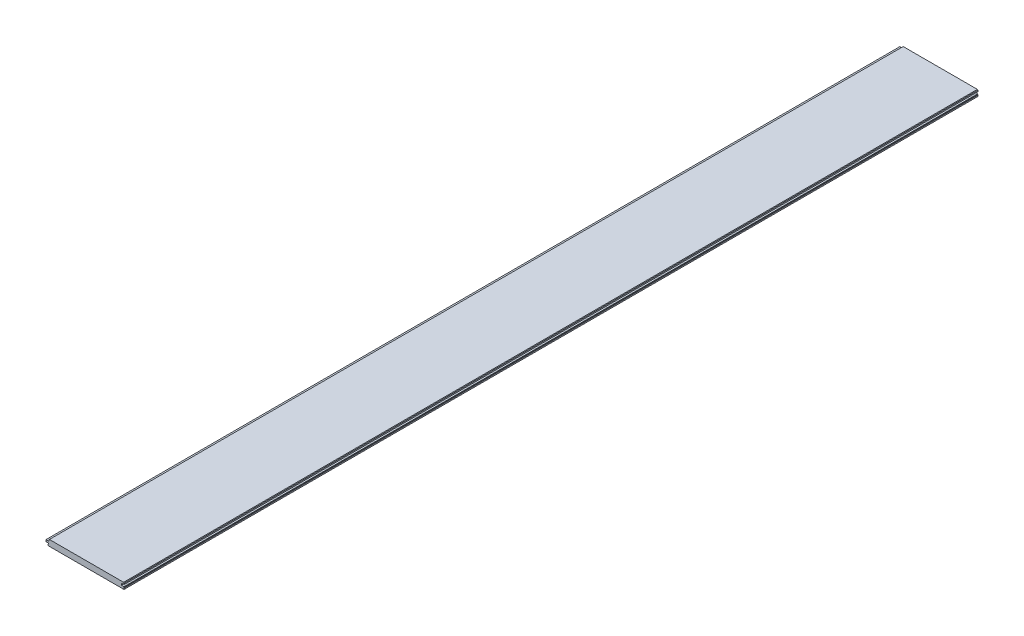
ISO-10303-21;
HEADER;
FILE_DESCRIPTION(('STEP AP214'),'2;1');
FILE_NAME('part.step','',(''),(''),'','','');
FILE_SCHEMA(('AUTOMOTIVE_DESIGN { 1 0 10303 214 1 1 1 1 }'));
ENDSEC;
DATA;
#1=APPLICATION_CONTEXT('core data for automotive mechanical design processes');
#2=APPLICATION_PROTOCOL_DEFINITION('international standard','automotive_design',2000,#1);
#3=PRODUCT_CONTEXT('',#1,'mechanical');
#4=PRODUCT('Part','Part','',(#3));
#5=PRODUCT_RELATED_PRODUCT_CATEGORY('part','',(#4));
#6=PRODUCT_DEFINITION_FORMATION('','',#4);
#7=PRODUCT_DEFINITION_CONTEXT('part definition',#1,'design');
#8=PRODUCT_DEFINITION('design','',#6,#7);
#9=PRODUCT_DEFINITION_SHAPE('','',#8);
#10=(LENGTH_UNIT() NAMED_UNIT(*) SI_UNIT(.MILLI.,.METRE.));
#11=(NAMED_UNIT(*) PLANE_ANGLE_UNIT() SI_UNIT($,.RADIAN.));
#12=(NAMED_UNIT(*) SI_UNIT($,.STERADIAN.) SOLID_ANGLE_UNIT());
#13=UNCERTAINTY_MEASURE_WITH_UNIT(LENGTH_MEASURE(1.E-05),#10,'distance_accuracy_value','');
#14=(GEOMETRIC_REPRESENTATION_CONTEXT(3) GLOBAL_UNCERTAINTY_ASSIGNED_CONTEXT((#13)) GLOBAL_UNIT_ASSIGNED_CONTEXT((#10,
#11,#12)) REPRESENTATION_CONTEXT('',''));
#15=CARTESIAN_POINT('',(0.,0.,0.));
#16=DIRECTION('',(0.,0.,1.));
#17=DIRECTION('',(1.,0.,0.));
#18=AXIS2_PLACEMENT_3D('',#15,#16,#17);
#19=CARTESIAN_POINT('',(94.83725,0.,1066.8));
#20=DIRECTION('',(-1.,0.,0.));
#21=DIRECTION('',(0.,0.,1.));
#22=AXIS2_PLACEMENT_3D('',#19,#20,#21);
#23=PLANE('',#22);
#24=DIRECTION('',(0.,1.,0.));
#25=VECTOR('',#24,1.);
#26=CARTESIAN_POINT('',(94.83725,0.,-1066.8));
#27=LINE('',#26,#25);
#28=CARTESIAN_POINT('',(94.83725,3.12419999999999,-1066.8));
#29=VERTEX_POINT('',#28);
#30=CARTESIAN_POINT('',(94.83725,6.28649999999999,-1066.8));
#31=VERTEX_POINT('',#30);
#32=EDGE_CURVE('E206',#29,#31,#27,.T.);
#33=ORIENTED_EDGE('',*,*,#32,.T.);
#34=DIRECTION('',(0.,0.,-1.));
#35=VECTOR('',#34,1.);
#36=CARTESIAN_POINT('',(94.83725,6.28649999999999,1066.8));
#37=LINE('',#36,#35);
#38=CARTESIAN_POINT('',(94.83725,6.28649999999999,1066.8));
#39=VERTEX_POINT('',#38);
#40=EDGE_CURVE('E12',#39,#31,#37,.T.);
#41=ORIENTED_EDGE('',*,*,#40,.F.);
#42=DIRECTION('',(0.,1.,0.));
#43=VECTOR('',#42,1.);
#44=CARTESIAN_POINT('',(94.83725,0.,1066.8));
#45=LINE('',#44,#43);
#46=CARTESIAN_POINT('',(94.83725,3.12419999999999,1066.8));
#47=VERTEX_POINT('',#46);
#48=EDGE_CURVE('E256',#47,#39,#45,.T.);
#49=ORIENTED_EDGE('',*,*,#48,.F.);
#50=DIRECTION('',(0.,0.,-1.));
#51=VECTOR('',#50,1.);
#52=CARTESIAN_POINT('',(94.83725,3.12419999999999,1066.8));
#53=LINE('',#52,#51);
#54=EDGE_CURVE('E53',#47,#29,#53,.T.);
#55=ORIENTED_EDGE('',*,*,#54,.T.);
#56=EDGE_LOOP('',(#33,#41,#49,#55));
#57=FACE_BOUND('',#56,.T.);
#58=ADVANCED_FACE('F37',(#57),#23,.F.);
#59=CARTESIAN_POINT('',(50.5618749999997,50.561875,1066.8));
#60=DIRECTION('',(-0.707106781186545,-0.707106781186549,0.));
#61=DIRECTION('',(0.70710678118655,-0.707106781186546,0.));
#62=AXIS2_PLACEMENT_3D('',#59,#60,#61);
#63=PLANE('',#62);
#64=DIRECTION('',(-0.70710678118655,0.707106781186546,0.));
#65=VECTOR('',#64,1.);
#66=CARTESIAN_POINT('',(50.5618749999997,50.561875,-1066.8));
#67=LINE('',#66,#65);
#68=CARTESIAN_POINT('',(93.56725,7.55649999999999,-1066.8));
#69=VERTEX_POINT('',#68);
#70=EDGE_CURVE('E208',#31,#69,#67,.T.);
#71=ORIENTED_EDGE('',*,*,#70,.T.);
#72=DIRECTION('',(0.,0.,-1.));
#73=VECTOR('',#72,1.);
#74=CARTESIAN_POINT('',(93.56725,7.55649999999999,1066.8));
#75=LINE('',#74,#73);
#76=CARTESIAN_POINT('',(93.56725,7.55649999999999,1066.8));
#77=VERTEX_POINT('',#76);
#78=EDGE_CURVE('E45',#77,#69,#75,.T.);
#79=ORIENTED_EDGE('',*,*,#78,.F.);
#80=DIRECTION('',(-0.70710678118655,0.707106781186546,0.));
#81=VECTOR('',#80,1.);
#82=CARTESIAN_POINT('',(50.5618749999997,50.561875,1066.8));
#83=LINE('',#82,#81);
#84=EDGE_CURVE('E127',#39,#77,#83,.T.);
#85=ORIENTED_EDGE('',*,*,#84,.F.);
#86=ORIENTED_EDGE('',*,*,#40,.T.);
#87=EDGE_LOOP('',(#71,#79,#85,#86));
#88=FACE_BOUND('',#87,.T.);
#89=ADVANCED_FACE('F299',(#88),#63,.F.);
#90=CARTESIAN_POINT('',(0.,7.55649999999999,1066.8));
#91=DIRECTION('',(0.,1.,0.));
#92=DIRECTION('',(0.,0.,1.));
#93=AXIS2_PLACEMENT_3D('',#90,#91,#92);
#94=PLANE('',#93);
#95=DIRECTION('',(1.,0.,0.));
#96=VECTOR('',#95,1.);
#97=CARTESIAN_POINT('',(0.,7.55649999999999,-1066.8));
#98=LINE('',#97,#96);
#99=CARTESIAN_POINT('',(-91.86545,7.55649999999999,-1066.8));
#100=VERTEX_POINT('',#99);
#101=EDGE_CURVE('E211',#100,#69,#98,.T.);
#102=ORIENTED_EDGE('',*,*,#101,.F.);
#103=DIRECTION('',(0.,0.,-1.));
#104=VECTOR('',#103,1.);
#105=CARTESIAN_POINT('',(-91.86545,7.55649999999999,1066.8));
#106=LINE('',#105,#104);
#107=CARTESIAN_POINT('',(-91.86545,7.55649999999999,1066.8));
#108=VERTEX_POINT('',#107);
#109=EDGE_CURVE('E292',#108,#100,#106,.T.);
#110=ORIENTED_EDGE('',*,*,#109,.F.);
#111=DIRECTION('',(1.,0.,0.));
#112=VECTOR('',#111,1.);
#113=CARTESIAN_POINT('',(0.,7.55649999999999,1066.8));
#114=LINE('',#113,#112);
#115=EDGE_CURVE('E298',#108,#77,#114,.T.);
#116=ORIENTED_EDGE('',*,*,#115,.T.);
#117=ORIENTED_EDGE('',*,*,#78,.T.);
#118=EDGE_LOOP('',(#102,#110,#116,#117));
#119=FACE_BOUND('',#118,.T.);
#120=ADVANCED_FACE('F296',(#119),#94,.T.);
#121=CARTESIAN_POINT('',(-49.7109749999998,49.710975,1066.8));
#122=DIRECTION('',(-0.707106781186545,0.707106781186549,0.));
#123=DIRECTION('',(-0.70710678118655,-0.707106781186546,0.));
#124=AXIS2_PLACEMENT_3D('',#121,#122,#123);
#125=PLANE('',#124);
#126=DIRECTION('',(0.70710678118655,0.707106781186546,0.));
#127=VECTOR('',#126,1.);
#128=CARTESIAN_POINT('',(-49.7109749999998,49.710975,-1066.8));
#129=LINE('',#128,#127);
#130=CARTESIAN_POINT('',(-93.13545,6.28649999999998,-1066.8));
#131=VERTEX_POINT('',#130);
#132=EDGE_CURVE('E214',#131,#100,#129,.T.);
#133=ORIENTED_EDGE('',*,*,#132,.F.);
#134=DIRECTION('',(0.,0.,-1.));
#135=VECTOR('',#134,1.);
#136=CARTESIAN_POINT('',(-93.13545,6.28649999999998,1066.8));
#137=LINE('',#136,#135);
#138=CARTESIAN_POINT('',(-93.13545,6.28649999999998,1066.8));
#139=VERTEX_POINT('',#138);
#140=EDGE_CURVE('E290',#139,#131,#137,.T.);
#141=ORIENTED_EDGE('',*,*,#140,.F.);
#142=DIRECTION('',(0.70710678118655,0.707106781186546,0.));
#143=VECTOR('',#142,1.);
#144=CARTESIAN_POINT('',(-49.7109749999998,49.710975,1066.8));
#145=LINE('',#144,#143);
#146=EDGE_CURVE('E310',#139,#108,#145,.T.);
#147=ORIENTED_EDGE('',*,*,#146,.T.);
#148=ORIENTED_EDGE('',*,*,#109,.T.);
#149=EDGE_LOOP('',(#133,#141,#147,#148));
#150=FACE_BOUND('',#149,.T.);
#151=ADVANCED_FACE('F307',(#150),#125,.T.);
#152=CARTESIAN_POINT('',(-93.13545,0.,1066.8));
#153=DIRECTION('',(-1.,0.,0.));
#154=DIRECTION('',(0.,0.,1.));
#155=AXIS2_PLACEMENT_3D('',#152,#153,#154);
#156=PLANE('',#155);
#157=DIRECTION('',(0.,1.,0.));
#158=VECTOR('',#157,1.);
#159=CARTESIAN_POINT('',(-93.13545,0.,-1066.8));
#160=LINE('',#159,#158);
#161=CARTESIAN_POINT('',(-93.13545,2.98449999999999,-1066.8));
#162=VERTEX_POINT('',#161);
#163=EDGE_CURVE('E217',#162,#131,#160,.T.);
#164=ORIENTED_EDGE('',*,*,#163,.F.);
#165=DIRECTION('',(0.,0.,-1.));
#166=VECTOR('',#165,1.);
#167=CARTESIAN_POINT('',(-93.13545,2.98449999999999,1066.8));
#168=LINE('',#167,#166);
#169=CARTESIAN_POINT('',(-93.13545,2.98449999999999,1066.8));
#170=VERTEX_POINT('',#169);
#171=EDGE_CURVE('E288',#170,#162,#168,.T.);
#172=ORIENTED_EDGE('',*,*,#171,.F.);
#173=DIRECTION('',(0.,1.,0.));
#174=VECTOR('',#173,1.);
#175=CARTESIAN_POINT('',(-93.13545,0.,1066.8));
#176=LINE('',#175,#174);
#177=EDGE_CURVE('E314',#170,#139,#176,.T.);
#178=ORIENTED_EDGE('',*,*,#177,.T.);
#179=ORIENTED_EDGE('',*,*,#140,.T.);
#180=EDGE_LOOP('',(#164,#172,#178,#179));
#181=FACE_BOUND('',#180,.T.);
#182=ADVANCED_FACE('F369',(#181),#156,.T.);
#183=CARTESIAN_POINT('',(0.,2.98450000000001,1066.8));
#184=DIRECTION('',(0.,-1.,0.));
#185=DIRECTION('',(1.,0.,0.));
#186=AXIS2_PLACEMENT_3D('',#183,#184,#185);
#187=PLANE('',#186);
#188=DIRECTION('',(-1.,0.,0.));
#189=VECTOR('',#188,1.);
#190=CARTESIAN_POINT('',(0.,2.98450000000001,-1066.8));
#191=LINE('',#190,#189);
#192=CARTESIAN_POINT('',(-100.37445,2.98449999999999,-1066.8));
#193=VERTEX_POINT('',#192);
#194=EDGE_CURVE('E220',#162,#193,#191,.T.);
#195=ORIENTED_EDGE('',*,*,#194,.T.);
#196=DIRECTION('',(0.,0.,-1.));
#197=VECTOR('',#196,1.);
#198=CARTESIAN_POINT('',(-100.37445,2.98449999999999,1066.8));
#199=LINE('',#198,#197);
#200=CARTESIAN_POINT('',(-100.37445,2.98449999999999,1066.8));
#201=VERTEX_POINT('',#200);
#202=EDGE_CURVE('E285',#201,#193,#199,.T.);
#203=ORIENTED_EDGE('',*,*,#202,.F.);
#204=DIRECTION('',(-1.,0.,0.));
#205=VECTOR('',#204,1.);
#206=CARTESIAN_POINT('',(0.,2.98450000000001,1066.8));
#207=LINE('',#206,#205);
#208=EDGE_CURVE('E320',#170,#201,#207,.T.);
#209=ORIENTED_EDGE('',*,*,#208,.F.);
#210=ORIENTED_EDGE('',*,*,#171,.T.);
#211=EDGE_LOOP('',(#195,#203,#209,#210));
#212=FACE_BOUND('',#211,.T.);
#213=ADVANCED_FACE('F372',(#212),#187,.F.);
#214=CARTESIAN_POINT('',(-100.37445,0.,1066.8));
#215=DIRECTION('',(1.,0.,0.));
#216=DIRECTION('',(0.,0.,-1.));
#217=AXIS2_PLACEMENT_3D('',#214,#215,#216);
#218=PLANE('',#217);
#219=DIRECTION('',(0.,-1.,0.));
#220=VECTOR('',#219,1.);
#221=CARTESIAN_POINT('',(-100.37445,0.,-1066.8));
#222=LINE('',#221,#220);
#223=CARTESIAN_POINT('',(-100.37445,-1.58750000000001,-1066.8));
#224=VERTEX_POINT('',#223);
#225=EDGE_CURVE('E222',#193,#224,#222,.T.);
#226=ORIENTED_EDGE('',*,*,#225,.T.);
#227=DIRECTION('',(0.,0.,-1.));
#228=VECTOR('',#227,1.);
#229=CARTESIAN_POINT('',(-100.37445,-1.58750000000001,1066.8));
#230=LINE('',#229,#228);
#231=CARTESIAN_POINT('',(-100.37445,-1.58750000000001,1066.8));
#232=VERTEX_POINT('',#231);
#233=EDGE_CURVE('E282',#232,#224,#230,.T.);
#234=ORIENTED_EDGE('',*,*,#233,.F.);
#235=DIRECTION('',(0.,-1.,0.));
#236=VECTOR('',#235,1.);
#237=CARTESIAN_POINT('',(-100.37445,0.,1066.8));
#238=LINE('',#237,#236);
#239=EDGE_CURVE('E322',#201,#232,#238,.T.);
#240=ORIENTED_EDGE('',*,*,#239,.F.);
#241=ORIENTED_EDGE('',*,*,#202,.T.);
#242=EDGE_LOOP('',(#226,#234,#240,#241));
#243=FACE_BOUND('',#242,.T.);
#244=ADVANCED_FACE('F376',(#243),#218,.F.);
#245=CARTESIAN_POINT('',(0.,-1.58750000000001,1066.8));
#246=DIRECTION('',(0.,1.,0.));
#247=DIRECTION('',(0.,0.,1.));
#248=AXIS2_PLACEMENT_3D('',#245,#246,#247);
#249=PLANE('',#248);
#250=DIRECTION('',(1.,0.,0.));
#251=VECTOR('',#250,1.);
#252=CARTESIAN_POINT('',(0.,-1.58750000000001,-1066.8));
#253=LINE('',#252,#251);
#254=CARTESIAN_POINT('',(-94.53245,-1.58750000000001,-1066.8));
#255=VERTEX_POINT('',#254);
#256=EDGE_CURVE('E224',#224,#255,#253,.T.);
#257=ORIENTED_EDGE('',*,*,#256,.T.);
#258=DIRECTION('',(0.,0.,-1.));
#259=VECTOR('',#258,1.);
#260=CARTESIAN_POINT('',(-94.53245,-1.58750000000001,1066.8));
#261=LINE('',#260,#259);
#262=CARTESIAN_POINT('',(-94.53245,-1.58750000000001,1066.8));
#263=VERTEX_POINT('',#262);
#264=EDGE_CURVE('E279',#263,#255,#261,.T.);
#265=ORIENTED_EDGE('',*,*,#264,.F.);
#266=DIRECTION('',(1.,0.,0.));
#267=VECTOR('',#266,1.);
#268=CARTESIAN_POINT('',(0.,-1.58750000000001,1066.8));
#269=LINE('',#268,#267);
#270=EDGE_CURVE('E324',#232,#263,#269,.T.);
#271=ORIENTED_EDGE('',*,*,#270,.F.);
#272=ORIENTED_EDGE('',*,*,#233,.T.);
#273=EDGE_LOOP('',(#257,#265,#271,#272));
#274=FACE_BOUND('',#273,.T.);
#275=ADVANCED_FACE('F380',(#274),#249,.F.);
#276=CARTESIAN_POINT('',(-94.53245,0.,1066.8));
#277=DIRECTION('',(1.,0.,0.));
#278=DIRECTION('',(0.,0.,-1.));
#279=AXIS2_PLACEMENT_3D('',#276,#277,#278);
#280=PLANE('',#279);
#281=DIRECTION('',(0.,-1.,0.));
#282=VECTOR('',#281,1.);
#283=CARTESIAN_POINT('',(-94.53245,0.,-1066.8));
#284=LINE('',#283,#282);
#285=CARTESIAN_POINT('',(-94.53245,-3.11149999999999,-1066.8));
#286=VERTEX_POINT('',#285);
#287=EDGE_CURVE('E226',#255,#286,#284,.T.);
#288=ORIENTED_EDGE('',*,*,#287,.T.);
#289=DIRECTION('',(0.,0.,-1.));
#290=VECTOR('',#289,1.);
#291=CARTESIAN_POINT('',(-94.53245,-3.11149999999999,1066.8));
#292=LINE('',#291,#290);
#293=CARTESIAN_POINT('',(-94.53245,-3.11149999999999,1066.8));
#294=VERTEX_POINT('',#293);
#295=EDGE_CURVE('E276',#294,#286,#292,.T.);
#296=ORIENTED_EDGE('',*,*,#295,.F.);
#297=DIRECTION('',(0.,-1.,0.));
#298=VECTOR('',#297,1.);
#299=CARTESIAN_POINT('',(-94.53245,0.,1066.8));
#300=LINE('',#299,#298);
#301=EDGE_CURVE('E326',#263,#294,#300,.T.);
#302=ORIENTED_EDGE('',*,*,#301,.F.);
#303=ORIENTED_EDGE('',*,*,#264,.T.);
#304=EDGE_LOOP('',(#288,#296,#302,#303));
#305=FACE_BOUND('',#304,.T.);
#306=ADVANCED_FACE('F384',(#305),#280,.F.);
#307=CARTESIAN_POINT('',(-45.7104750000013,45.7104750000001,1066.8));
#308=DIRECTION('',(0.707106781186557,-0.707106781186538,0.));
#309=DIRECTION('',(0.707106781186538,0.707106781186557,0.));
#310=AXIS2_PLACEMENT_3D('',#307,#308,#309);
#311=PLANE('',#310);
#312=DIRECTION('',(-0.707106781186538,-0.707106781186557,0.));
#313=VECTOR('',#312,1.);
#314=CARTESIAN_POINT('',(-45.7104750000013,45.7104750000001,-1066.8));
#315=LINE('',#314,#313);
#316=CARTESIAN_POINT('',(-95.16745,-3.74650000000001,-1066.8));
#317=VERTEX_POINT('',#316);
#318=EDGE_CURVE('E228',#286,#317,#315,.T.);
#319=ORIENTED_EDGE('',*,*,#318,.T.);
#320=DIRECTION('',(0.,0.,-1.));
#321=VECTOR('',#320,1.);
#322=CARTESIAN_POINT('',(-95.16745,-3.74650000000001,1066.8));
#323=LINE('',#322,#321);
#324=CARTESIAN_POINT('',(-95.16745,-3.74650000000001,1066.8));
#325=VERTEX_POINT('',#324);
#326=EDGE_CURVE('E273',#325,#317,#323,.T.);
#327=ORIENTED_EDGE('',*,*,#326,.F.);
#328=DIRECTION('',(-0.707106781186538,-0.707106781186557,0.));
#329=VECTOR('',#328,1.);
#330=CARTESIAN_POINT('',(-45.7104750000013,45.7104750000001,1066.8));
#331=LINE('',#330,#329);
#332=EDGE_CURVE('E328',#294,#325,#331,.T.);
#333=ORIENTED_EDGE('',*,*,#332,.F.);
#334=ORIENTED_EDGE('',*,*,#295,.T.);
#335=EDGE_LOOP('',(#319,#327,#333,#334));
#336=FACE_BOUND('',#335,.T.);
#337=ADVANCED_FACE('F388',(#336),#311,.F.);
#338=CARTESIAN_POINT('',(-95.16745,0.,1066.8));
#339=DIRECTION('',(1.,0.,0.));
#340=DIRECTION('',(0.,0.,-1.));
#341=AXIS2_PLACEMENT_3D('',#338,#339,#340);
#342=PLANE('',#341);
#343=DIRECTION('',(0.,-1.,0.));
#344=VECTOR('',#343,1.);
#345=CARTESIAN_POINT('',(-95.16745,0.,-1066.8));
#346=LINE('',#345,#344);
#347=CARTESIAN_POINT('',(-95.16745,-6.92150000000001,-1066.8));
#348=VERTEX_POINT('',#347);
#349=EDGE_CURVE('E230',#317,#348,#346,.T.);
#350=ORIENTED_EDGE('',*,*,#349,.T.);
#351=DIRECTION('',(0.,0.,-1.));
#352=VECTOR('',#351,1.);
#353=CARTESIAN_POINT('',(-95.16745,-6.92150000000001,1066.8));
#354=LINE('',#353,#352);
#355=CARTESIAN_POINT('',(-95.16745,-6.92150000000001,1066.8));
#356=VERTEX_POINT('',#355);
#357=EDGE_CURVE('E271',#356,#348,#354,.T.);
#358=ORIENTED_EDGE('',*,*,#357,.F.);
#359=DIRECTION('',(0.,-1.,0.));
#360=VECTOR('',#359,1.);
#361=CARTESIAN_POINT('',(-95.16745,0.,1066.8));
#362=LINE('',#361,#360);
#363=EDGE_CURVE('E330',#325,#356,#362,.T.);
#364=ORIENTED_EDGE('',*,*,#363,.F.);
#365=ORIENTED_EDGE('',*,*,#326,.T.);
#366=EDGE_LOOP('',(#350,#358,#364,#365));
#367=FACE_BOUND('',#366,.T.);
#368=ADVANCED_FACE('F392',(#367),#342,.F.);
#369=CARTESIAN_POINT('',(-51.0444749999992,-51.0444750000001,1066.8));
#370=DIRECTION('',(-0.707106781186542,-0.707106781186553,0.));
#371=DIRECTION('',(0.707106781186553,-0.707106781186542,0.));
#372=AXIS2_PLACEMENT_3D('',#369,#370,#371);
#373=PLANE('',#372);
#374=DIRECTION('',(-0.707106781186553,0.707106781186542,0.));
#375=VECTOR('',#374,1.);
#376=CARTESIAN_POINT('',(-51.0444749999992,-51.0444750000001,-1066.8));
#377=LINE('',#376,#375);
#378=CARTESIAN_POINT('',(-94.53245,-7.55650000000001,-1066.8));
#379=VERTEX_POINT('',#378);
#380=EDGE_CURVE('E233',#379,#348,#377,.T.);
#381=ORIENTED_EDGE('',*,*,#380,.F.);
#382=DIRECTION('',(0.,0.,-1.));
#383=VECTOR('',#382,1.);
#384=CARTESIAN_POINT('',(-94.53245,-7.55650000000001,1066.8));
#385=LINE('',#384,#383);
#386=CARTESIAN_POINT('',(-94.53245,-7.55650000000001,1066.8));
#387=VERTEX_POINT('',#386);
#388=EDGE_CURVE('E269',#387,#379,#385,.T.);
#389=ORIENTED_EDGE('',*,*,#388,.F.);
#390=DIRECTION('',(-0.707106781186553,0.707106781186542,0.));
#391=VECTOR('',#390,1.);
#392=CARTESIAN_POINT('',(-51.0444749999992,-51.0444750000001,1066.8));
#393=LINE('',#392,#391);
#394=EDGE_CURVE('E332',#387,#356,#393,.T.);
#395=ORIENTED_EDGE('',*,*,#394,.T.);
#396=ORIENTED_EDGE('',*,*,#357,.T.);
#397=EDGE_LOOP('',(#381,#389,#395,#396));
#398=FACE_BOUND('',#397,.T.);
#399=ADVANCED_FACE('F396',(#398),#373,.T.);
#400=CARTESIAN_POINT('',(0.,-7.55650000000001,1066.8));
#401=DIRECTION('',(0.,1.,0.));
#402=DIRECTION('',(0.,0.,1.));
#403=AXIS2_PLACEMENT_3D('',#400,#401,#402);
#404=PLANE('',#403);
#405=DIRECTION('',(1.,0.,0.));
#406=VECTOR('',#405,1.);
#407=CARTESIAN_POINT('',(0.,-7.55650000000001,-1066.8));
#408=LINE('',#407,#406);
#409=CARTESIAN_POINT('',(94.53245,-7.5565,-1066.8));
#410=VERTEX_POINT('',#409);
#411=EDGE_CURVE('E236',#379,#410,#408,.T.);
#412=ORIENTED_EDGE('',*,*,#411,.T.);
#413=DIRECTION('',(0.,0.,-1.));
#414=VECTOR('',#413,1.);
#415=CARTESIAN_POINT('',(94.53245,-7.5565,1066.8));
#416=LINE('',#415,#414);
#417=CARTESIAN_POINT('',(94.53245,-7.5565,1066.8));
#418=VERTEX_POINT('',#417);
#419=EDGE_CURVE('E266',#418,#410,#416,.T.);
#420=ORIENTED_EDGE('',*,*,#419,.F.);
#421=DIRECTION('',(1.,0.,0.));
#422=VECTOR('',#421,1.);
#423=CARTESIAN_POINT('',(0.,-7.55650000000001,1066.8));
#424=LINE('',#423,#422);
#425=EDGE_CURVE('E335',#387,#418,#424,.T.);
#426=ORIENTED_EDGE('',*,*,#425,.F.);
#427=ORIENTED_EDGE('',*,*,#388,.T.);
#428=EDGE_LOOP('',(#412,#420,#426,#427));
#429=FACE_BOUND('',#428,.T.);
#430=ADVANCED_FACE('F400',(#429),#404,.F.);
#431=CARTESIAN_POINT('',(51.0444750000007,-51.044475,1066.8));
#432=DIRECTION('',(-0.707106781186552,0.707106781186543,0.));
#433=DIRECTION('',(-0.707106781186543,-0.707106781186552,0.));
#434=AXIS2_PLACEMENT_3D('',#431,#432,#433);
#435=PLANE('',#434);
#436=DIRECTION('',(0.707106781186543,0.707106781186552,0.));
#437=VECTOR('',#436,1.);
#438=CARTESIAN_POINT('',(51.0444750000007,-51.044475,-1066.8));
#439=LINE('',#438,#437);
#440=CARTESIAN_POINT('',(95.16745,-6.92150000000001,-1066.8));
#441=VERTEX_POINT('',#440);
#442=EDGE_CURVE('E238',#410,#441,#439,.T.);
#443=ORIENTED_EDGE('',*,*,#442,.T.);
#444=DIRECTION('',(0.,0.,-1.));
#445=VECTOR('',#444,1.);
#446=CARTESIAN_POINT('',(95.16745,-6.92150000000001,1066.8));
#447=LINE('',#446,#445);
#448=CARTESIAN_POINT('',(95.16745,-6.92150000000001,1066.8));
#449=VERTEX_POINT('',#448);
#450=EDGE_CURVE('E264',#449,#441,#447,.T.);
#451=ORIENTED_EDGE('',*,*,#450,.F.);
#452=DIRECTION('',(0.707106781186543,0.707106781186552,0.));
#453=VECTOR('',#452,1.);
#454=CARTESIAN_POINT('',(51.0444750000007,-51.044475,1066.8));
#455=LINE('',#454,#453);
#456=EDGE_CURVE('E337',#418,#449,#455,.T.);
#457=ORIENTED_EDGE('',*,*,#456,.F.);
#458=ORIENTED_EDGE('',*,*,#419,.T.);
#459=EDGE_LOOP('',(#443,#451,#457,#458));
#460=FACE_BOUND('',#459,.T.);
#461=ADVANCED_FACE('F404',(#460),#435,.F.);
#462=CARTESIAN_POINT('',(95.16745,0.,1066.8));
#463=DIRECTION('',(1.,0.,0.));
#464=DIRECTION('',(0.,0.,-1.));
#465=AXIS2_PLACEMENT_3D('',#462,#463,#464);
#466=PLANE('',#465);
#467=DIRECTION('',(0.,-1.,0.));
#468=VECTOR('',#467,1.);
#469=CARTESIAN_POINT('',(95.16745,0.,-1066.8));
#470=LINE('',#469,#468);
#471=CARTESIAN_POINT('',(95.16745,-3.74650000000002,-1066.8));
#472=VERTEX_POINT('',#471);
#473=EDGE_CURVE('E241',#472,#441,#470,.T.);
#474=ORIENTED_EDGE('',*,*,#473,.F.);
#475=DIRECTION('',(0.,0.,-1.));
#476=VECTOR('',#475,1.);
#477=CARTESIAN_POINT('',(95.16745,-3.74650000000002,1066.8));
#478=LINE('',#477,#476);
#479=CARTESIAN_POINT('',(95.16745,-3.74650000000002,1066.8));
#480=VERTEX_POINT('',#479);
#481=EDGE_CURVE('E262',#480,#472,#478,.T.);
#482=ORIENTED_EDGE('',*,*,#481,.F.);
#483=DIRECTION('',(0.,-1.,0.));
#484=VECTOR('',#483,1.);
#485=CARTESIAN_POINT('',(95.16745,0.,1066.8));
#486=LINE('',#485,#484);
#487=EDGE_CURVE('E339',#480,#449,#486,.T.);
#488=ORIENTED_EDGE('',*,*,#487,.T.);
#489=ORIENTED_EDGE('',*,*,#450,.T.);
#490=EDGE_LOOP('',(#474,#482,#488,#489));
#491=FACE_BOUND('',#490,.T.);
#492=ADVANCED_FACE('F408',(#491),#466,.T.);
#493=CARTESIAN_POINT('',(45.7104750000007,45.710475,1066.8));
#494=DIRECTION('',(0.707106781186553,0.707106781186542,0.));
#495=DIRECTION('',(-0.707106781186542,0.707106781186553,0.));
#496=AXIS2_PLACEMENT_3D('',#493,#494,#495);
#497=PLANE('',#496);
#498=DIRECTION('',(0.707106781186542,-0.707106781186553,0.));
#499=VECTOR('',#498,1.);
#500=CARTESIAN_POINT('',(45.7104750000007,45.710475,-1066.8));
#501=LINE('',#500,#499);
#502=CARTESIAN_POINT('',(94.53245,-3.1115,-1066.8));
#503=VERTEX_POINT('',#502);
#504=EDGE_CURVE('E244',#503,#472,#501,.T.);
#505=ORIENTED_EDGE('',*,*,#504,.F.);
#506=DIRECTION('',(0.,0.,-1.));
#507=VECTOR('',#506,1.);
#508=CARTESIAN_POINT('',(94.53245,-3.1115,1066.8));
#509=LINE('',#508,#507);
#510=CARTESIAN_POINT('',(94.53245,-3.1115,1066.8));
#511=VERTEX_POINT('',#510);
#512=EDGE_CURVE('E260',#511,#503,#509,.T.);
#513=ORIENTED_EDGE('',*,*,#512,.F.);
#514=DIRECTION('',(0.707106781186542,-0.707106781186553,0.));
#515=VECTOR('',#514,1.);
#516=CARTESIAN_POINT('',(45.7104750000007,45.710475,1066.8));
#517=LINE('',#516,#515);
#518=EDGE_CURVE('E342',#511,#480,#517,.T.);
#519=ORIENTED_EDGE('',*,*,#518,.T.);
#520=ORIENTED_EDGE('',*,*,#481,.T.);
#521=EDGE_LOOP('',(#505,#513,#519,#520));
#522=FACE_BOUND('',#521,.T.);
#523=ADVANCED_FACE('F412',(#522),#497,.T.);
#524=CARTESIAN_POINT('',(94.53245,0.,1066.8));
#525=DIRECTION('',(1.,0.,0.));
#526=DIRECTION('',(0.,0.,-1.));
#527=AXIS2_PLACEMENT_3D('',#524,#525,#526);
#528=PLANE('',#527);
#529=DIRECTION('',(0.,-1.,0.));
#530=VECTOR('',#529,1.);
#531=CARTESIAN_POINT('',(94.53245,0.,-1066.8));
#532=LINE('',#531,#530);
#533=CARTESIAN_POINT('',(94.53245,-1.49860000000001,-1066.8));
#534=VERTEX_POINT('',#533);
#535=EDGE_CURVE('E247',#534,#503,#532,.T.);
#536=ORIENTED_EDGE('',*,*,#535,.F.);
#537=DIRECTION('',(0.,0.,-1.));
#538=VECTOR('',#537,1.);
#539=CARTESIAN_POINT('',(94.53245,-1.49860000000001,1066.8));
#540=LINE('',#539,#538);
#541=CARTESIAN_POINT('',(94.53245,-1.49860000000001,1066.8));
#542=VERTEX_POINT('',#541);
#543=EDGE_CURVE('E188',#542,#534,#540,.T.);
#544=ORIENTED_EDGE('',*,*,#543,.F.);
#545=DIRECTION('',(0.,-1.,0.));
#546=VECTOR('',#545,1.);
#547=CARTESIAN_POINT('',(94.53245,0.,1066.8));
#548=LINE('',#547,#546);
#549=EDGE_CURVE('E198',#542,#511,#548,.T.);
#550=ORIENTED_EDGE('',*,*,#549,.T.);
#551=ORIENTED_EDGE('',*,*,#512,.T.);
#552=EDGE_LOOP('',(#536,#544,#550,#551));
#553=FACE_BOUND('',#552,.T.);
#554=ADVANCED_FACE('F346',(#553),#528,.T.);
#555=CARTESIAN_POINT('',(0.,-1.49860000000001,1066.8));
#556=DIRECTION('',(0.,1.,0.));
#557=DIRECTION('',(0.,0.,1.));
#558=AXIS2_PLACEMENT_3D('',#555,#556,#557);
#559=PLANE('',#558);
#560=DIRECTION('',(1.,0.,0.));
#561=VECTOR('',#560,1.);
#562=CARTESIAN_POINT('',(0.,-1.49860000000001,-1066.8));
#563=LINE('',#562,#561);
#564=CARTESIAN_POINT('',(87.91575,-1.49860000000001,-1066.8));
#565=VERTEX_POINT('',#564);
#566=EDGE_CURVE('E184',#565,#534,#563,.T.);
#567=ORIENTED_EDGE('',*,*,#566,.F.);
#568=DIRECTION('',(0.,0.,-1.));
#569=VECTOR('',#568,1.);
#570=CARTESIAN_POINT('',(87.91575,-1.49860000000001,1066.8));
#571=LINE('',#570,#569);
#572=CARTESIAN_POINT('',(87.91575,-1.49860000000001,1066.8));
#573=VERTEX_POINT('',#572);
#574=EDGE_CURVE('E179',#573,#565,#571,.T.);
#575=ORIENTED_EDGE('',*,*,#574,.F.);
#576=DIRECTION('',(1.,0.,0.));
#577=VECTOR('',#576,1.);
#578=CARTESIAN_POINT('',(0.,-1.49860000000001,1066.8));
#579=LINE('',#578,#577);
#580=EDGE_CURVE('E182',#573,#542,#579,.T.);
#581=ORIENTED_EDGE('',*,*,#580,.T.);
#582=ORIENTED_EDGE('',*,*,#543,.T.);
#583=EDGE_LOOP('',(#567,#575,#581,#582));
#584=FACE_BOUND('',#583,.T.);
#585=ADVANCED_FACE('F181',(#584),#559,.T.);
#586=CARTESIAN_POINT('',(87.91575,0.,1066.8));
#587=DIRECTION('',(1.,0.,0.));
#588=DIRECTION('',(0.,0.,-1.));
#589=AXIS2_PLACEMENT_3D('',#586,#587,#588);
#590=PLANE('',#589);
#591=DIRECTION('',(0.,-1.,0.));
#592=VECTOR('',#591,1.);
#593=CARTESIAN_POINT('',(87.91575,0.,-1066.8));
#594=LINE('',#593,#592);
#595=CARTESIAN_POINT('',(87.91575,3.12419999999999,-1066.8));
#596=VERTEX_POINT('',#595);
#597=EDGE_CURVE('E251',#596,#565,#594,.T.);
#598=ORIENTED_EDGE('',*,*,#597,.F.);
#599=DIRECTION('',(0.,0.,-1.));
#600=VECTOR('',#599,1.);
#601=CARTESIAN_POINT('',(87.91575,3.12419999999999,1066.8));
#602=LINE('',#601,#600);
#603=CARTESIAN_POINT('',(87.91575,3.12419999999999,1066.8));
#604=VERTEX_POINT('',#603);
#605=EDGE_CURVE('E115',#604,#596,#602,.T.);
#606=ORIENTED_EDGE('',*,*,#605,.F.);
#607=DIRECTION('',(0.,-1.,0.));
#608=VECTOR('',#607,1.);
#609=CARTESIAN_POINT('',(87.91575,0.,1066.8));
#610=LINE('',#609,#608);
#611=EDGE_CURVE('E195',#604,#573,#610,.T.);
#612=ORIENTED_EDGE('',*,*,#611,.T.);
#613=ORIENTED_EDGE('',*,*,#574,.T.);
#614=EDGE_LOOP('',(#598,#606,#612,#613));
#615=FACE_BOUND('',#614,.T.);
#616=ADVANCED_FACE('F200',(#615),#590,.T.);
#617=CARTESIAN_POINT('',(0.,3.12419999999998,1066.8));
#618=DIRECTION('',(0.,-1.,0.));
#619=DIRECTION('',(1.,0.,0.));
#620=AXIS2_PLACEMENT_3D('',#617,#618,#619);
#621=PLANE('',#620);
#622=DIRECTION('',(-1.,0.,0.));
#623=VECTOR('',#622,1.);
#624=CARTESIAN_POINT('',(0.,3.12419999999998,-1066.8));
#625=LINE('',#624,#623);
#626=EDGE_CURVE('E253',#29,#596,#625,.T.);
#627=ORIENTED_EDGE('',*,*,#626,.F.);
#628=ORIENTED_EDGE('',*,*,#54,.F.);
#629=DIRECTION('',(-1.,0.,0.));
#630=VECTOR('',#629,1.);
#631=CARTESIAN_POINT('',(0.,3.12419999999998,1066.8));
#632=LINE('',#631,#630);
#633=EDGE_CURVE('E201',#47,#604,#632,.T.);
#634=ORIENTED_EDGE('',*,*,#633,.T.);
#635=ORIENTED_EDGE('',*,*,#605,.T.);
#636=EDGE_LOOP('',(#627,#628,#634,#635));
#637=FACE_BOUND('',#636,.T.);
#638=ADVANCED_FACE('F348',(#637),#621,.T.);
#639=CARTESIAN_POINT('',(0.,0.,1066.8));
#640=DIRECTION('',(0.,0.,1.));
#641=DIRECTION('',(1.,0.,0.));
#642=AXIS2_PLACEMENT_3D('',#639,#640,#641);
#643=PLANE('',#642);
#644=ORIENTED_EDGE('',*,*,#48,.T.);
#645=ORIENTED_EDGE('',*,*,#84,.T.);
#646=ORIENTED_EDGE('',*,*,#115,.F.);
#647=ORIENTED_EDGE('',*,*,#146,.F.);
#648=ORIENTED_EDGE('',*,*,#177,.F.);
#649=ORIENTED_EDGE('',*,*,#208,.T.);
#650=ORIENTED_EDGE('',*,*,#239,.T.);
#651=ORIENTED_EDGE('',*,*,#270,.T.);
#652=ORIENTED_EDGE('',*,*,#301,.T.);
#653=ORIENTED_EDGE('',*,*,#332,.T.);
#654=ORIENTED_EDGE('',*,*,#363,.T.);
#655=ORIENTED_EDGE('',*,*,#394,.F.);
#656=ORIENTED_EDGE('',*,*,#425,.T.);
#657=ORIENTED_EDGE('',*,*,#456,.T.);
#658=ORIENTED_EDGE('',*,*,#487,.F.);
#659=ORIENTED_EDGE('',*,*,#518,.F.);
#660=ORIENTED_EDGE('',*,*,#549,.F.);
#661=ORIENTED_EDGE('',*,*,#580,.F.);
#662=ORIENTED_EDGE('',*,*,#611,.F.);
#663=ORIENTED_EDGE('',*,*,#633,.F.);
#664=EDGE_LOOP('',(#644,#645,#646,#647,#648,#649,#650,#651,#652,#653,#654,#655,#656,#657,#658,
#659,#660,#661,#662,#663));
#665=FACE_BOUND('',#664,.T.);
#666=ADVANCED_FACE('F193',(#665),#643,.T.);
#667=CARTESIAN_POINT('',(0.,0.,-1066.8));
#668=DIRECTION('',(0.,0.,1.));
#669=DIRECTION('',(1.,0.,0.));
#670=AXIS2_PLACEMENT_3D('',#667,#668,#669);
#671=PLANE('',#670);
#672=ORIENTED_EDGE('',*,*,#32,.F.);
#673=ORIENTED_EDGE('',*,*,#626,.T.);
#674=ORIENTED_EDGE('',*,*,#597,.T.);
#675=ORIENTED_EDGE('',*,*,#566,.T.);
#676=ORIENTED_EDGE('',*,*,#535,.T.);
#677=ORIENTED_EDGE('',*,*,#504,.T.);
#678=ORIENTED_EDGE('',*,*,#473,.T.);
#679=ORIENTED_EDGE('',*,*,#442,.F.);
#680=ORIENTED_EDGE('',*,*,#411,.F.);
#681=ORIENTED_EDGE('',*,*,#380,.T.);
#682=ORIENTED_EDGE('',*,*,#349,.F.);
#683=ORIENTED_EDGE('',*,*,#318,.F.);
#684=ORIENTED_EDGE('',*,*,#287,.F.);
#685=ORIENTED_EDGE('',*,*,#256,.F.);
#686=ORIENTED_EDGE('',*,*,#225,.F.);
#687=ORIENTED_EDGE('',*,*,#194,.F.);
#688=ORIENTED_EDGE('',*,*,#163,.T.);
#689=ORIENTED_EDGE('',*,*,#132,.T.);
#690=ORIENTED_EDGE('',*,*,#101,.T.);
#691=ORIENTED_EDGE('',*,*,#70,.F.);
#692=EDGE_LOOP('',(#672,#673,#674,#675,#676,#677,#678,#679,#680,#681,#682,#683,#684,#685,#686,
#687,#688,#689,#690,#691));
#693=FACE_BOUND('',#692,.T.);
#694=ADVANCED_FACE('F302',(#693),#671,.F.);
#695=CLOSED_SHELL('',(#58,#89,#120,#151,#182,#213,#244,#275,#306,#337,#368,#399,#430,#461,#492,
#523,#554,#585,#616,#638,#666,#694));
#696=MANIFOLD_SOLID_BREP('B2',#695);
#697=ADVANCED_BREP_SHAPE_REPRESENTATION('',(#18,#696),#14);
#698=SHAPE_DEFINITION_REPRESENTATION(#9,#697);
ENDSEC;
END-ISO-10303-21;
